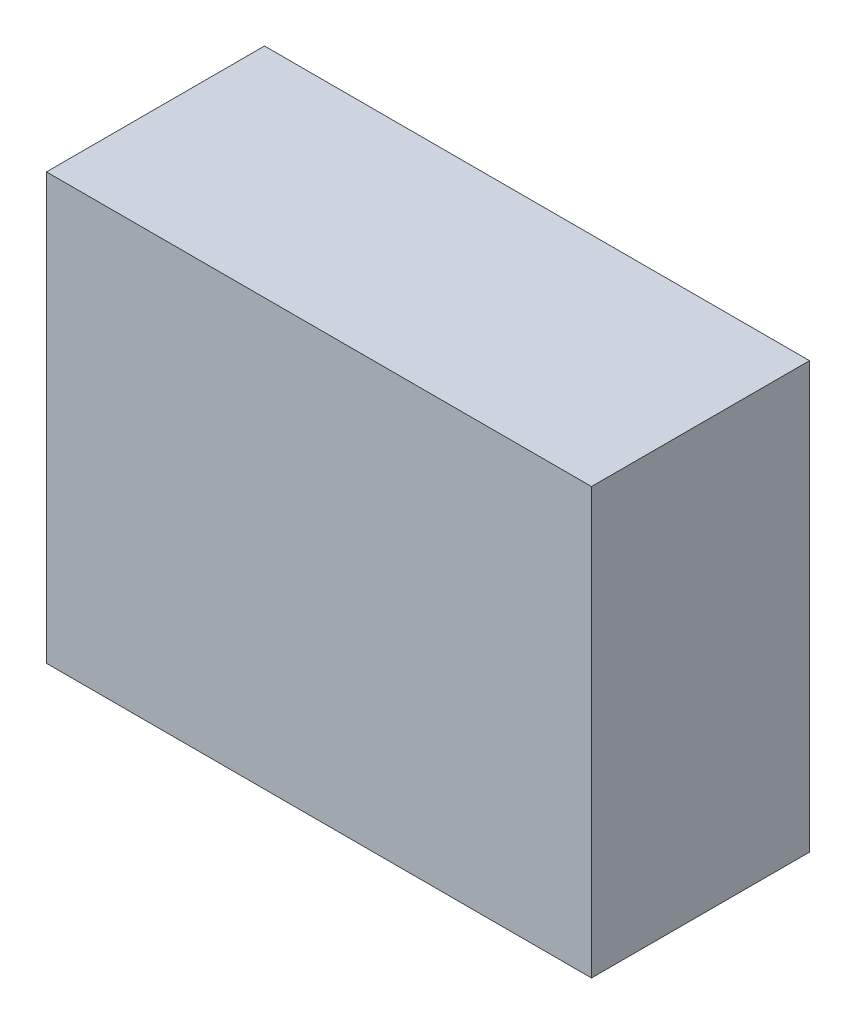
ISO-10303-21;
HEADER;
FILE_DESCRIPTION(('STEP AP214'),'2;1');
FILE_NAME('part.step','',(''),(''),'','','');
FILE_SCHEMA(('AUTOMOTIVE_DESIGN { 1 0 10303 214 1 1 1 1 }'));
ENDSEC;
DATA;
#1=APPLICATION_CONTEXT('core data for automotive mechanical design processes');
#2=APPLICATION_PROTOCOL_DEFINITION('international standard','automotive_design',2000,#1);
#3=PRODUCT_CONTEXT('',#1,'mechanical');
#4=PRODUCT('Part','Part','',(#3));
#5=PRODUCT_RELATED_PRODUCT_CATEGORY('part','',(#4));
#6=PRODUCT_DEFINITION_FORMATION('','',#4);
#7=PRODUCT_DEFINITION_CONTEXT('part definition',#1,'design');
#8=PRODUCT_DEFINITION('design','',#6,#7);
#9=PRODUCT_DEFINITION_SHAPE('','',#8);
#10=(LENGTH_UNIT() NAMED_UNIT(*) SI_UNIT(.MILLI.,.METRE.));
#11=(NAMED_UNIT(*) PLANE_ANGLE_UNIT() SI_UNIT($,.RADIAN.));
#12=(NAMED_UNIT(*) SI_UNIT($,.STERADIAN.) SOLID_ANGLE_UNIT());
#13=UNCERTAINTY_MEASURE_WITH_UNIT(LENGTH_MEASURE(1.E-05),#10,'distance_accuracy_value','');
#14=(GEOMETRIC_REPRESENTATION_CONTEXT(3) GLOBAL_UNCERTAINTY_ASSIGNED_CONTEXT((#13)) GLOBAL_UNIT_ASSIGNED_CONTEXT((#10,
#11,#12)) REPRESENTATION_CONTEXT('',''));
#15=CARTESIAN_POINT('',(0.,0.,0.));
#16=DIRECTION('',(0.,0.,1.));
#17=DIRECTION('',(1.,0.,0.));
#18=AXIS2_PLACEMENT_3D('',#15,#16,#17);
#19=CARTESIAN_POINT('',(10.5,-4.1,-2.1));
#20=DIRECTION('',(0.,0.,1.));
#21=DIRECTION('',(1.,0.,0.));
#22=AXIS2_PLACEMENT_3D('',#19,#20,#21);
#23=PLANE('',#22);
#24=DIRECTION('',(0.,1.,0.));
#25=VECTOR('',#24,1.);
#26=CARTESIAN_POINT('',(0.,-4.1,-2.1));
#27=LINE('',#26,#25);
#28=CARTESIAN_POINT('',(0.,-4.1,-2.1));
#29=VERTEX_POINT('',#28);
#30=CARTESIAN_POINT('',(0.,4.1,-2.1));
#31=VERTEX_POINT('',#30);
#32=EDGE_CURVE('E104',#29,#31,#27,.T.);
#33=ORIENTED_EDGE('',*,*,#32,.T.);
#34=DIRECTION('',(-1.,0.,0.));
#35=VECTOR('',#34,1.);
#36=CARTESIAN_POINT('',(10.5,4.1,-2.1));
#37=LINE('',#36,#35);
#38=CARTESIAN_POINT('',(10.5,4.1,-2.1));
#39=VERTEX_POINT('',#38);
#40=EDGE_CURVE('E11',#39,#31,#37,.T.);
#41=ORIENTED_EDGE('',*,*,#40,.F.);
#42=DIRECTION('',(0.,1.,0.));
#43=VECTOR('',#42,1.);
#44=CARTESIAN_POINT('',(10.5,-4.1,-2.1));
#45=LINE('',#44,#43);
#46=CARTESIAN_POINT('',(10.5,-4.1,-2.1));
#47=VERTEX_POINT('',#46);
#48=EDGE_CURVE('E92',#47,#39,#45,.T.);
#49=ORIENTED_EDGE('',*,*,#48,.F.);
#50=DIRECTION('',(-1.,0.,0.));
#51=VECTOR('',#50,1.);
#52=CARTESIAN_POINT('',(10.5,-4.1,-2.1));
#53=LINE('',#52,#51);
#54=EDGE_CURVE('E100',#47,#29,#53,.T.);
#55=ORIENTED_EDGE('',*,*,#54,.T.);
#56=EDGE_LOOP('',(#33,#41,#49,#55));
#57=FACE_BOUND('',#56,.T.);
#58=ADVANCED_FACE('F41',(#57),#23,.F.);
#59=CARTESIAN_POINT('',(10.5,4.1,2.1));
#60=DIRECTION('',(0.,-1.,0.));
#61=DIRECTION('',(0.,0.,-1.));
#62=AXIS2_PLACEMENT_3D('',#59,#60,#61);
#63=PLANE('',#62);
#64=DIRECTION('',(0.,0.,1.));
#65=VECTOR('',#64,1.);
#66=CARTESIAN_POINT('',(0.,4.1,2.1));
#67=LINE('',#66,#65);
#68=CARTESIAN_POINT('',(0.,4.1,2.1));
#69=VERTEX_POINT('',#68);
#70=EDGE_CURVE('E96',#31,#69,#67,.T.);
#71=ORIENTED_EDGE('',*,*,#70,.T.);
#72=DIRECTION('',(-1.,0.,0.));
#73=VECTOR('',#72,1.);
#74=CARTESIAN_POINT('',(10.5,4.1,2.1));
#75=LINE('',#74,#73);
#76=CARTESIAN_POINT('',(10.5,4.1,2.1));
#77=VERTEX_POINT('',#76);
#78=EDGE_CURVE('E49',#77,#69,#75,.T.);
#79=ORIENTED_EDGE('',*,*,#78,.F.);
#80=DIRECTION('',(0.,0.,1.));
#81=VECTOR('',#80,1.);
#82=CARTESIAN_POINT('',(10.5,4.1,2.1));
#83=LINE('',#82,#81);
#84=EDGE_CURVE('E87',#39,#77,#83,.T.);
#85=ORIENTED_EDGE('',*,*,#84,.F.);
#86=ORIENTED_EDGE('',*,*,#40,.T.);
#87=EDGE_LOOP('',(#71,#79,#85,#86));
#88=FACE_BOUND('',#87,.T.);
#89=ADVANCED_FACE('F95',(#88),#63,.F.);
#90=CARTESIAN_POINT('',(10.5,-4.1,2.1));
#91=DIRECTION('',(0.,0.,-1.));
#92=DIRECTION('',(-1.,0.,0.));
#93=AXIS2_PLACEMENT_3D('',#90,#91,#92);
#94=PLANE('',#93);
#95=DIRECTION('',(0.,-1.,0.));
#96=VECTOR('',#95,1.);
#97=CARTESIAN_POINT('',(0.,-4.1,2.1));
#98=LINE('',#97,#96);
#99=CARTESIAN_POINT('',(0.,-4.1,2.1));
#100=VERTEX_POINT('',#99);
#101=EDGE_CURVE('E74',#69,#100,#98,.T.);
#102=ORIENTED_EDGE('',*,*,#101,.T.);
#103=DIRECTION('',(-1.,0.,0.));
#104=VECTOR('',#103,1.);
#105=CARTESIAN_POINT('',(10.5,-4.1,2.1));
#106=LINE('',#105,#104);
#107=CARTESIAN_POINT('',(10.5,-4.1,2.1));
#108=VERTEX_POINT('',#107);
#109=EDGE_CURVE('E97',#108,#100,#106,.T.);
#110=ORIENTED_EDGE('',*,*,#109,.F.);
#111=DIRECTION('',(0.,-1.,0.));
#112=VECTOR('',#111,1.);
#113=CARTESIAN_POINT('',(10.5,-4.1,2.1));
#114=LINE('',#113,#112);
#115=EDGE_CURVE('E90',#77,#108,#114,.T.);
#116=ORIENTED_EDGE('',*,*,#115,.F.);
#117=ORIENTED_EDGE('',*,*,#78,.T.);
#118=EDGE_LOOP('',(#102,#110,#116,#117));
#119=FACE_BOUND('',#118,.T.);
#120=ADVANCED_FACE('F98',(#119),#94,.F.);
#121=CARTESIAN_POINT('',(10.5,-4.1,2.1));
#122=DIRECTION('',(0.,1.,0.));
#123=DIRECTION('',(0.,0.,1.));
#124=AXIS2_PLACEMENT_3D('',#121,#122,#123);
#125=PLANE('',#124);
#126=DIRECTION('',(0.,0.,-1.));
#127=VECTOR('',#126,1.);
#128=CARTESIAN_POINT('',(0.,-4.1,2.1));
#129=LINE('',#128,#127);
#130=EDGE_CURVE('E80',#100,#29,#129,.T.);
#131=ORIENTED_EDGE('',*,*,#130,.T.);
#132=ORIENTED_EDGE('',*,*,#54,.F.);
#133=DIRECTION('',(0.,0.,-1.));
#134=VECTOR('',#133,1.);
#135=CARTESIAN_POINT('',(10.5,-4.1,2.1));
#136=LINE('',#135,#134);
#137=EDGE_CURVE('E57',#108,#47,#136,.T.);
#138=ORIENTED_EDGE('',*,*,#137,.F.);
#139=ORIENTED_EDGE('',*,*,#109,.T.);
#140=EDGE_LOOP('',(#131,#132,#138,#139));
#141=FACE_BOUND('',#140,.T.);
#142=ADVANCED_FACE('F111',(#141),#125,.F.);
#143=CARTESIAN_POINT('',(10.5,0.,0.));
#144=DIRECTION('',(-1.,0.,0.));
#145=DIRECTION('',(0.,0.,1.));
#146=AXIS2_PLACEMENT_3D('',#143,#144,#145);
#147=PLANE('',#146);
#148=ORIENTED_EDGE('',*,*,#48,.T.);
#149=ORIENTED_EDGE('',*,*,#84,.T.);
#150=ORIENTED_EDGE('',*,*,#115,.T.);
#151=ORIENTED_EDGE('',*,*,#137,.T.);
#152=EDGE_LOOP('',(#148,#149,#150,#151));
#153=FACE_BOUND('',#152,.T.);
#154=ADVANCED_FACE('F88',(#153),#147,.F.);
#155=CARTESIAN_POINT('',(0.,0.,0.));
#156=DIRECTION('',(-1.,0.,0.));
#157=DIRECTION('',(0.,0.,1.));
#158=AXIS2_PLACEMENT_3D('',#155,#156,#157);
#159=PLANE('',#158);
#160=ORIENTED_EDGE('',*,*,#32,.F.);
#161=ORIENTED_EDGE('',*,*,#130,.F.);
#162=ORIENTED_EDGE('',*,*,#101,.F.);
#163=ORIENTED_EDGE('',*,*,#70,.F.);
#164=EDGE_LOOP('',(#160,#161,#162,#163));
#165=FACE_BOUND('',#164,.T.);
#166=ADVANCED_FACE('F114',(#165),#159,.T.);
#167=CLOSED_SHELL('',(#58,#89,#120,#142,#154,#166));
#168=MANIFOLD_SOLID_BREP('B2',#167);
#169=ADVANCED_BREP_SHAPE_REPRESENTATION('',(#18,#168),#14);
#170=SHAPE_DEFINITION_REPRESENTATION(#9,#169);
ENDSEC;
END-ISO-10303-21;
